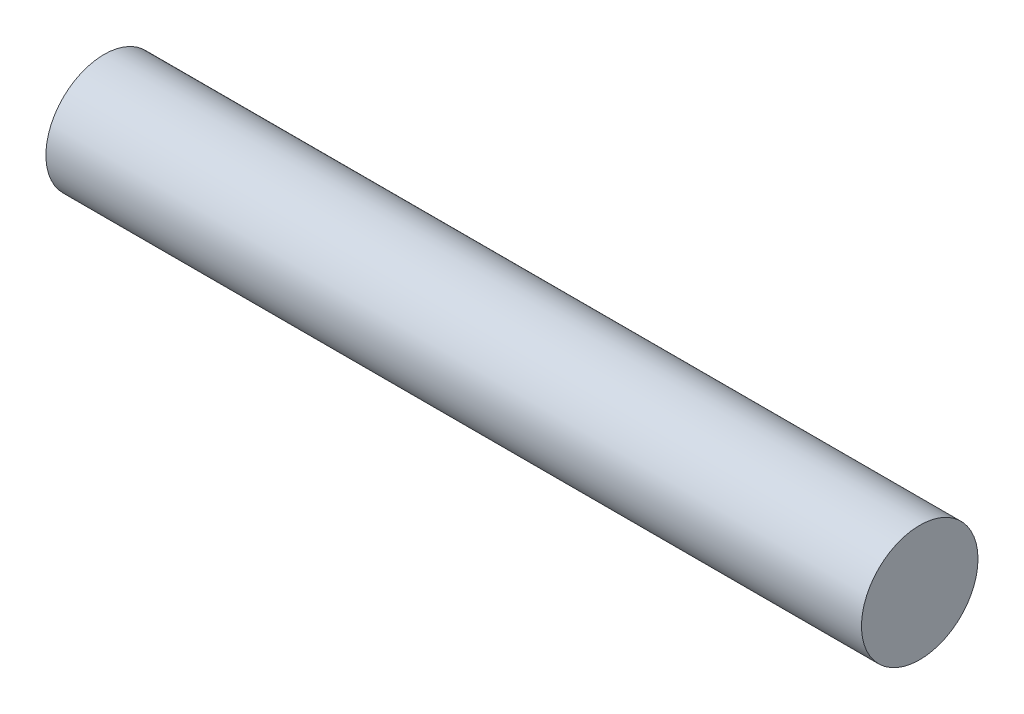
ISO-10303-21;
HEADER;
FILE_DESCRIPTION(('STEP AP214'),'2;1');
FILE_NAME('part.step','',(''),(''),'','','');
FILE_SCHEMA(('AUTOMOTIVE_DESIGN { 1 0 10303 214 1 1 1 1 }'));
ENDSEC;
DATA;
#1=APPLICATION_CONTEXT('core data for automotive mechanical design processes');
#2=APPLICATION_PROTOCOL_DEFINITION('international standard','automotive_design',2000,#1);
#3=PRODUCT_CONTEXT('',#1,'mechanical');
#4=PRODUCT('Part','Part','',(#3));
#5=PRODUCT_RELATED_PRODUCT_CATEGORY('part','',(#4));
#6=PRODUCT_DEFINITION_FORMATION('','',#4);
#7=PRODUCT_DEFINITION_CONTEXT('part definition',#1,'design');
#8=PRODUCT_DEFINITION('design','',#6,#7);
#9=PRODUCT_DEFINITION_SHAPE('','',#8);
#10=(LENGTH_UNIT() NAMED_UNIT(*) SI_UNIT(.MILLI.,.METRE.));
#11=(NAMED_UNIT(*) PLANE_ANGLE_UNIT() SI_UNIT($,.RADIAN.));
#12=(NAMED_UNIT(*) SI_UNIT($,.STERADIAN.) SOLID_ANGLE_UNIT());
#13=UNCERTAINTY_MEASURE_WITH_UNIT(LENGTH_MEASURE(1.E-05),#10,'distance_accuracy_value','');
#14=(GEOMETRIC_REPRESENTATION_CONTEXT(3) GLOBAL_UNCERTAINTY_ASSIGNED_CONTEXT((#13)) GLOBAL_UNIT_ASSIGNED_CONTEXT((#10,
#11,#12)) REPRESENTATION_CONTEXT('',''));
#15=CARTESIAN_POINT('',(0.,0.,0.));
#16=DIRECTION('',(0.,0.,1.));
#17=DIRECTION('',(1.,0.,0.));
#18=AXIS2_PLACEMENT_3D('',#15,#16,#17);
#19=CARTESIAN_POINT('',(35.,0.,0.));
#20=DIRECTION('',(-1.,0.,0.));
#21=DIRECTION('',(0.,0.,1.));
#22=AXIS2_PLACEMENT_3D('',#19,#20,#21);
#23=CYLINDRICAL_SURFACE('',#22,2.5);
#24=CARTESIAN_POINT('',(35.,0.,0.));
#25=DIRECTION('',(1.,0.,0.));
#26=DIRECTION('',(0.,0.,-1.));
#27=AXIS2_PLACEMENT_3D('',#24,#25,#26);
#28=CIRCLE('',#27,2.5);
#29=CARTESIAN_POINT('',(35.,0.,-2.5));
#30=VERTEX_POINT('',#29);
#31=EDGE_CURVE('E10',#30,#30,#28,.T.);
#32=ORIENTED_EDGE('',*,*,#31,.F.);
#33=EDGE_LOOP('',(#32));
#34=FACE_BOUND('',#33,.T.);
#35=CARTESIAN_POINT('',(0.,0.,0.));
#36=DIRECTION('',(1.,0.,0.));
#37=DIRECTION('',(0.,0.,-1.));
#38=AXIS2_PLACEMENT_3D('',#35,#36,#37);
#39=CIRCLE('',#38,2.5);
#40=CARTESIAN_POINT('',(0.,0.,-2.5));
#41=VERTEX_POINT('',#40);
#42=EDGE_CURVE('E34',#41,#41,#39,.T.);
#43=ORIENTED_EDGE('',*,*,#42,.T.);
#44=EDGE_LOOP('',(#43));
#45=FACE_BOUND('',#44,.T.);
#46=ADVANCED_FACE('F31',(#34,#45),#23,.T.);
#47=CARTESIAN_POINT('',(35.,0.,0.));
#48=DIRECTION('',(1.,0.,0.));
#49=DIRECTION('',(0.,0.,-1.));
#50=AXIS2_PLACEMENT_3D('',#47,#48,#49);
#51=PLANE('',#50);
#52=ORIENTED_EDGE('',*,*,#31,.T.);
#53=EDGE_LOOP('',(#52));
#54=FACE_BOUND('',#53,.T.);
#55=ADVANCED_FACE('F46',(#54),#51,.T.);
#56=CARTESIAN_POINT('',(0.,0.,0.));
#57=DIRECTION('',(1.,0.,0.));
#58=DIRECTION('',(0.,0.,-1.));
#59=AXIS2_PLACEMENT_3D('',#56,#57,#58);
#60=PLANE('',#59);
#61=ORIENTED_EDGE('',*,*,#42,.F.);
#62=EDGE_LOOP('',(#61));
#63=FACE_BOUND('',#62,.T.);
#64=ADVANCED_FACE('F44',(#63),#60,.F.);
#65=CLOSED_SHELL('',(#46,#55,#64));
#66=MANIFOLD_SOLID_BREP('B2',#65);
#67=ADVANCED_BREP_SHAPE_REPRESENTATION('',(#18,#66),#14);
#68=SHAPE_DEFINITION_REPRESENTATION(#9,#67);
ENDSEC;
END-ISO-10303-21;
